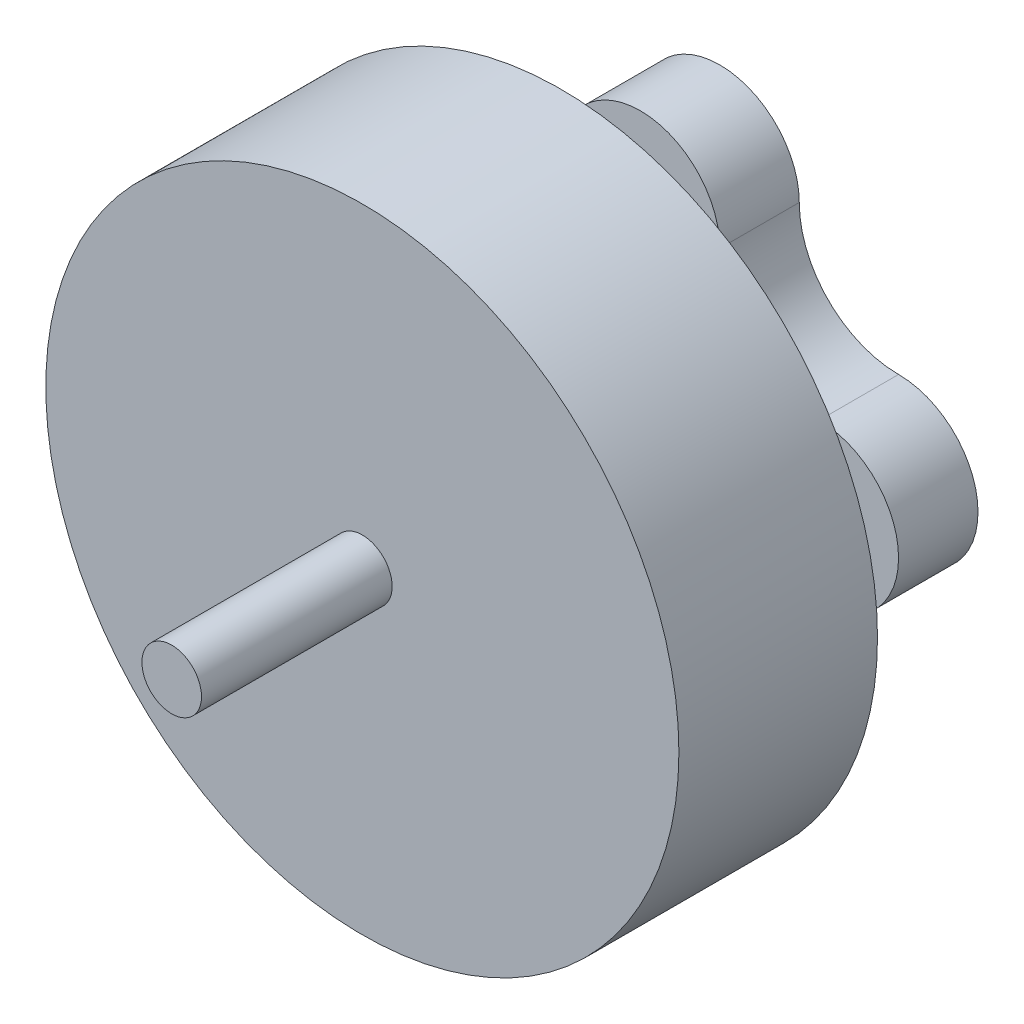
ISO-10303-21;
HEADER;
FILE_DESCRIPTION(('STEP AP214'),'2;1');
FILE_NAME('part.step','',(''),(''),'','','');
FILE_SCHEMA(('AUTOMOTIVE_DESIGN { 1 0 10303 214 1 1 1 1 }'));
ENDSEC;
DATA;
#1=APPLICATION_CONTEXT('core data for automotive mechanical design processes');
#2=APPLICATION_PROTOCOL_DEFINITION('international standard','automotive_design',2000,#1);
#3=PRODUCT_CONTEXT('',#1,'mechanical');
#4=PRODUCT('Part','Part','',(#3));
#5=PRODUCT_RELATED_PRODUCT_CATEGORY('part','',(#4));
#6=PRODUCT_DEFINITION_FORMATION('','',#4);
#7=PRODUCT_DEFINITION_CONTEXT('part definition',#1,'design');
#8=PRODUCT_DEFINITION('design','',#6,#7);
#9=PRODUCT_DEFINITION_SHAPE('','',#8);
#10=(LENGTH_UNIT() NAMED_UNIT(*) SI_UNIT(.MILLI.,.METRE.));
#11=(NAMED_UNIT(*) PLANE_ANGLE_UNIT() SI_UNIT($,.RADIAN.));
#12=(NAMED_UNIT(*) SI_UNIT($,.STERADIAN.) SOLID_ANGLE_UNIT());
#13=UNCERTAINTY_MEASURE_WITH_UNIT(LENGTH_MEASURE(1.E-05),#10,'distance_accuracy_value','');
#14=(GEOMETRIC_REPRESENTATION_CONTEXT(3) GLOBAL_UNCERTAINTY_ASSIGNED_CONTEXT((#13)) GLOBAL_UNIT_ASSIGNED_CONTEXT((#10,
#11,#12)) REPRESENTATION_CONTEXT('',''));
#15=CARTESIAN_POINT('',(0.,0.,0.));
#16=DIRECTION('',(0.,0.,1.));
#17=DIRECTION('',(1.,0.,0.));
#18=AXIS2_PLACEMENT_3D('',#15,#16,#17);
#19=CARTESIAN_POINT('',(0.,0.,5.));
#20=DIRECTION('',(0.,0.,-1.));
#21=DIRECTION('',(-1.,0.,0.));
#22=AXIS2_PLACEMENT_3D('',#19,#20,#21);
#23=CYLINDRICAL_SURFACE('',#22,7.97);
#24=CARTESIAN_POINT('',(0.,0.,5.));
#25=DIRECTION('',(0.,0.,1.));
#26=DIRECTION('',(1.,0.,0.));
#27=AXIS2_PLACEMENT_3D('',#24,#25,#26);
#28=CIRCLE('',#27,7.97);
#29=CARTESIAN_POINT('',(7.97,0.,5.));
#30=VERTEX_POINT('',#29);
#31=EDGE_CURVE('E157',#30,#30,#28,.T.);
#32=ORIENTED_EDGE('',*,*,#31,.F.);
#33=EDGE_LOOP('',(#32));
#34=FACE_BOUND('',#33,.T.);
#35=CARTESIAN_POINT('',(0.,0.,0.));
#36=DIRECTION('',(0.,0.,1.));
#37=DIRECTION('',(1.,0.,0.));
#38=AXIS2_PLACEMENT_3D('',#35,#36,#37);
#39=CIRCLE('',#38,7.97);
#40=CARTESIAN_POINT('',(7.97,0.,0.));
#41=VERTEX_POINT('',#40);
#42=EDGE_CURVE('E151',#41,#41,#39,.T.);
#43=ORIENTED_EDGE('',*,*,#42,.T.);
#44=EDGE_LOOP('',(#43));
#45=FACE_BOUND('',#44,.T.);
#46=ADVANCED_FACE('F148',(#34,#45),#23,.T.);
#47=CARTESIAN_POINT('',(0.,0.,5.));
#48=DIRECTION('',(0.,0.,1.));
#49=DIRECTION('',(1.,0.,0.));
#50=AXIS2_PLACEMENT_3D('',#47,#48,#49);
#51=PLANE('',#50);
#52=CARTESIAN_POINT('',(0.,0.,5.));
#53=DIRECTION('',(0.,0.,1.));
#54=DIRECTION('',(1.,0.,0.));
#55=AXIS2_PLACEMENT_3D('',#52,#53,#54);
#56=CIRCLE('',#55,0.75);
#57=CARTESIAN_POINT('',(0.75,0.,5.));
#58=VERTEX_POINT('',#57);
#59=EDGE_CURVE('E285',#58,#58,#56,.T.);
#60=ORIENTED_EDGE('',*,*,#59,.F.);
#61=EDGE_LOOP('',(#60));
#62=FACE_BOUND('',#61,.T.);
#63=ORIENTED_EDGE('',*,*,#31,.T.);
#64=EDGE_LOOP('',(#63));
#65=FACE_BOUND('',#64,.T.);
#66=ADVANCED_FACE('F301',(#62,#65),#51,.T.);
#67=CARTESIAN_POINT('',(0.,0.,0.));
#68=DIRECTION('',(0.,0.,1.));
#69=DIRECTION('',(1.,0.,0.));
#70=AXIS2_PLACEMENT_3D('',#67,#68,#69);
#71=PLANE('',#70);
#72=CARTESIAN_POINT('',(0.,0.,0.));
#73=DIRECTION('',(0.,0.,-1.));
#74=DIRECTION('',(-1.,0.,0.));
#75=AXIS2_PLACEMENT_3D('',#72,#73,#74);
#76=CIRCLE('',#75,2.5);
#77=CARTESIAN_POINT('',(-2.5,0.,0.));
#78=VERTEX_POINT('',#77);
#79=EDGE_CURVE('E12',#78,#78,#76,.T.);
#80=ORIENTED_EDGE('',*,*,#79,.F.);
#81=EDGE_LOOP('',(#80));
#82=FACE_BOUND('',#81,.T.);
#83=ORIENTED_EDGE('',*,*,#42,.F.);
#84=EDGE_LOOP('',(#83));
#85=FACE_BOUND('',#84,.T.);
#86=ADVANCED_FACE('F298',(#82,#85),#71,.F.);
#87=CARTESIAN_POINT('',(0.,0.,9.8));
#88=DIRECTION('',(0.,0.,-1.));
#89=DIRECTION('',(-1.,0.,0.));
#90=AXIS2_PLACEMENT_3D('',#87,#88,#89);
#91=CYLINDRICAL_SURFACE('',#90,0.75);
#92=CARTESIAN_POINT('',(0.,0.,9.8));
#93=DIRECTION('',(0.,0.,1.));
#94=DIRECTION('',(1.,0.,0.));
#95=AXIS2_PLACEMENT_3D('',#92,#93,#94);
#96=CIRCLE('',#95,0.75);
#97=CARTESIAN_POINT('',(0.75,0.,9.8));
#98=VERTEX_POINT('',#97);
#99=EDGE_CURVE('E287',#98,#98,#96,.T.);
#100=ORIENTED_EDGE('',*,*,#99,.F.);
#101=EDGE_LOOP('',(#100));
#102=FACE_BOUND('',#101,.T.);
#103=ORIENTED_EDGE('',*,*,#59,.T.);
#104=EDGE_LOOP('',(#103));
#105=FACE_BOUND('',#104,.T.);
#106=ADVANCED_FACE('F300',(#102,#105),#91,.T.);
#107=CARTESIAN_POINT('',(0.,0.,9.8));
#108=DIRECTION('',(0.,0.,1.));
#109=DIRECTION('',(1.,0.,0.));
#110=AXIS2_PLACEMENT_3D('',#107,#108,#109);
#111=PLANE('',#110);
#112=ORIENTED_EDGE('',*,*,#99,.T.);
#113=EDGE_LOOP('',(#112));
#114=FACE_BOUND('',#113,.T.);
#115=ADVANCED_FACE('F307',(#114),#111,.T.);
#116=CARTESIAN_POINT('',(0.,0.,-2.));
#117=DIRECTION('',(0.,0.,1.));
#118=DIRECTION('',(1.,0.,0.));
#119=AXIS2_PLACEMENT_3D('',#116,#117,#118);
#120=CYLINDRICAL_SURFACE('',#119,2.5);
#121=CARTESIAN_POINT('',(0.,0.,-2.));
#122=DIRECTION('',(0.,0.,-1.));
#123=DIRECTION('',(-1.,0.,0.));
#124=AXIS2_PLACEMENT_3D('',#121,#122,#123);
#125=CIRCLE('',#124,2.5);
#126=CARTESIAN_POINT('',(-2.5,0.,-2.));
#127=VERTEX_POINT('',#126);
#128=EDGE_CURVE('E283',#127,#127,#125,.T.);
#129=ORIENTED_EDGE('',*,*,#128,.F.);
#130=EDGE_LOOP('',(#129));
#131=FACE_BOUND('',#130,.T.);
#132=ORIENTED_EDGE('',*,*,#79,.T.);
#133=EDGE_LOOP('',(#132));
#134=FACE_BOUND('',#133,.T.);
#135=ADVANCED_FACE('F335',(#131,#134),#120,.T.);
#136=CARTESIAN_POINT('',(4.5,2.25,-4.));
#137=DIRECTION('',(0.,0.,1.));
#138=DIRECTION('',(1.,0.,0.));
#139=AXIS2_PLACEMENT_3D('',#136,#137,#138);
#140=PLANE('',#139);
#141=CARTESIAN_POINT('',(0.,4.5,-4.));
#142=DIRECTION('',(0.,0.,1.));
#143=DIRECTION('',(1.,0.,0.));
#144=AXIS2_PLACEMENT_3D('',#141,#142,#143);
#145=CIRCLE('',#144,0.999999999999998);
#146=CARTESIAN_POINT('',(0.999999999999997,4.5,-4.));
#147=VERTEX_POINT('',#146);
#148=EDGE_CURVE('E493',#147,#147,#145,.T.);
#149=ORIENTED_EDGE('',*,*,#148,.T.);
#150=EDGE_LOOP('',(#149));
#151=FACE_BOUND('',#150,.T.);
#152=CARTESIAN_POINT('',(-4.5,0.,-4.));
#153=DIRECTION('',(0.,0.,-1.));
#154=DIRECTION('',(-1.,0.,0.));
#155=AXIS2_PLACEMENT_3D('',#152,#153,#154);
#156=CIRCLE('',#155,0.999999999999998);
#157=CARTESIAN_POINT('',(-5.5,0.,-4.));
#158=VERTEX_POINT('',#157);
#159=EDGE_CURVE('E253',#158,#158,#156,.F.);
#160=ORIENTED_EDGE('',*,*,#159,.T.);
#161=EDGE_LOOP('',(#160));
#162=FACE_BOUND('',#161,.T.);
#163=CARTESIAN_POINT('',(4.5,4.5,-4.));
#164=DIRECTION('',(0.,0.,1.));
#165=DIRECTION('',(1.,0.,0.));
#166=AXIS2_PLACEMENT_3D('',#163,#164,#165);
#167=CIRCLE('',#166,2.5);
#168=CARTESIAN_POINT('',(2.,4.5,-4.));
#169=VERTEX_POINT('',#168);
#170=CARTESIAN_POINT('',(4.5,2.,-4.));
#171=VERTEX_POINT('',#170);
#172=EDGE_CURVE('E271',#169,#171,#167,.T.);
#173=ORIENTED_EDGE('',*,*,#172,.T.);
#174=CARTESIAN_POINT('',(4.5,0.,-4.));
#175=DIRECTION('',(0.,0.,-1.));
#176=DIRECTION('',(-1.,0.,0.));
#177=AXIS2_PLACEMENT_3D('',#174,#175,#176);
#178=CIRCLE('',#177,2.);
#179=CARTESIAN_POINT('',(4.5,-2.,-4.));
#180=VERTEX_POINT('',#179);
#181=EDGE_CURVE('E206',#171,#180,#178,.T.);
#182=ORIENTED_EDGE('',*,*,#181,.T.);
#183=CARTESIAN_POINT('',(4.5,-4.5,-4.));
#184=DIRECTION('',(0.,0.,-1.));
#185=DIRECTION('',(-1.,0.,0.));
#186=AXIS2_PLACEMENT_3D('',#183,#184,#185);
#187=CIRCLE('',#186,2.5);
#188=CARTESIAN_POINT('',(2.,-4.5,-4.));
#189=VERTEX_POINT('',#188);
#190=EDGE_CURVE('E520',#189,#180,#187,.T.);
#191=ORIENTED_EDGE('',*,*,#190,.F.);
#192=CARTESIAN_POINT('',(0.,-4.5,-4.));
#193=DIRECTION('',(0.,0.,-1.));
#194=DIRECTION('',(-1.,0.,0.));
#195=AXIS2_PLACEMENT_3D('',#192,#193,#194);
#196=CIRCLE('',#195,2.);
#197=CARTESIAN_POINT('',(-2.,-4.5,-4.));
#198=VERTEX_POINT('',#197);
#199=EDGE_CURVE('E245',#189,#198,#196,.T.);
#200=ORIENTED_EDGE('',*,*,#199,.T.);
#201=CARTESIAN_POINT('',(-4.5,-4.5,-4.));
#202=DIRECTION('',(0.,0.,-1.));
#203=DIRECTION('',(-1.,0.,0.));
#204=AXIS2_PLACEMENT_3D('',#201,#202,#203);
#205=CIRCLE('',#204,2.5);
#206=CARTESIAN_POINT('',(-4.5,-2.,-4.));
#207=VERTEX_POINT('',#206);
#208=EDGE_CURVE('E243',#207,#198,#205,.T.);
#209=ORIENTED_EDGE('',*,*,#208,.F.);
#210=CARTESIAN_POINT('',(-4.5,0.,-4.));
#211=DIRECTION('',(0.,0.,1.));
#212=DIRECTION('',(1.,0.,0.));
#213=AXIS2_PLACEMENT_3D('',#210,#211,#212);
#214=CIRCLE('',#213,2.);
#215=CARTESIAN_POINT('',(-4.5,2.,-4.));
#216=VERTEX_POINT('',#215);
#217=EDGE_CURVE('E226',#216,#207,#214,.T.);
#218=ORIENTED_EDGE('',*,*,#217,.F.);
#219=CARTESIAN_POINT('',(-4.5,4.5,-4.));
#220=DIRECTION('',(0.,0.,1.));
#221=DIRECTION('',(1.,0.,0.));
#222=AXIS2_PLACEMENT_3D('',#219,#220,#221);
#223=CIRCLE('',#222,2.5);
#224=CARTESIAN_POINT('',(-2.,4.5,-4.));
#225=VERTEX_POINT('',#224);
#226=EDGE_CURVE('E233',#216,#225,#223,.T.);
#227=ORIENTED_EDGE('',*,*,#226,.T.);
#228=CARTESIAN_POINT('',(0.,4.5,-4.));
#229=DIRECTION('',(0.,0.,1.));
#230=DIRECTION('',(1.,0.,0.));
#231=AXIS2_PLACEMENT_3D('',#228,#229,#230);
#232=CIRCLE('',#231,2.);
#233=EDGE_CURVE('E237',#169,#225,#232,.T.);
#234=ORIENTED_EDGE('',*,*,#233,.F.);
#235=EDGE_LOOP('',(#173,#182,#191,#200,#209,#218,#227,#234));
#236=FACE_BOUND('',#235,.T.);
#237=CARTESIAN_POINT('',(0.,-4.5,-4.));
#238=DIRECTION('',(0.,0.,-1.));
#239=DIRECTION('',(-1.,0.,0.));
#240=AXIS2_PLACEMENT_3D('',#237,#238,#239);
#241=CIRCLE('',#240,1.);
#242=CARTESIAN_POINT('',(-1.,-4.5,-4.));
#243=VERTEX_POINT('',#242);
#244=EDGE_CURVE('E508',#243,#243,#241,.T.);
#245=ORIENTED_EDGE('',*,*,#244,.F.);
#246=EDGE_LOOP('',(#245));
#247=FACE_BOUND('',#246,.T.);
#248=CARTESIAN_POINT('',(4.5,0.,-4.));
#249=DIRECTION('',(0.,0.,-1.));
#250=DIRECTION('',(-1.,0.,0.));
#251=AXIS2_PLACEMENT_3D('',#248,#249,#250);
#252=CIRCLE('',#251,1.);
#253=CARTESIAN_POINT('',(3.5,0.,-4.));
#254=VERTEX_POINT('',#253);
#255=EDGE_CURVE('E502',#254,#254,#252,.T.);
#256=ORIENTED_EDGE('',*,*,#255,.F.);
#257=EDGE_LOOP('',(#256));
#258=FACE_BOUND('',#257,.T.);
#259=ADVANCED_FACE('F240',(#151,#162,#236,#247,#258),#140,.F.);
#260=CARTESIAN_POINT('',(4.5,2.25,-2.));
#261=DIRECTION('',(0.,0.,1.));
#262=DIRECTION('',(1.,0.,0.));
#263=AXIS2_PLACEMENT_3D('',#260,#261,#262);
#264=PLANE('',#263);
#265=ORIENTED_EDGE('',*,*,#128,.T.);
#266=EDGE_LOOP('',(#265));
#267=FACE_BOUND('',#266,.T.);
#268=CARTESIAN_POINT('',(0.,4.5,-2.));
#269=DIRECTION('',(0.,0.,1.));
#270=DIRECTION('',(1.,0.,0.));
#271=AXIS2_PLACEMENT_3D('',#268,#269,#270);
#272=CIRCLE('',#271,0.999999999999998);
#273=CARTESIAN_POINT('',(0.999999999999997,4.5,-2.));
#274=VERTEX_POINT('',#273);
#275=EDGE_CURVE('E496',#274,#274,#272,.T.);
#276=ORIENTED_EDGE('',*,*,#275,.F.);
#277=EDGE_LOOP('',(#276));
#278=FACE_BOUND('',#277,.T.);
#279=CARTESIAN_POINT('',(0.,-4.5,-2.));
#280=DIRECTION('',(0.,0.,-1.));
#281=DIRECTION('',(-1.,0.,0.));
#282=AXIS2_PLACEMENT_3D('',#279,#280,#281);
#283=CIRCLE('',#282,1.);
#284=CARTESIAN_POINT('',(-1.,-4.5,-2.));
#285=VERTEX_POINT('',#284);
#286=EDGE_CURVE('E505',#285,#285,#283,.T.);
#287=ORIENTED_EDGE('',*,*,#286,.T.);
#288=EDGE_LOOP('',(#287));
#289=FACE_BOUND('',#288,.T.);
#290=CARTESIAN_POINT('',(-4.5,0.,-2.));
#291=DIRECTION('',(0.,0.,-1.));
#292=DIRECTION('',(-1.,0.,0.));
#293=AXIS2_PLACEMENT_3D('',#290,#291,#292);
#294=CIRCLE('',#293,0.999999999999998);
#295=CARTESIAN_POINT('',(-5.5,0.,-2.));
#296=VERTEX_POINT('',#295);
#297=EDGE_CURVE('E511',#296,#296,#294,.F.);
#298=ORIENTED_EDGE('',*,*,#297,.F.);
#299=EDGE_LOOP('',(#298));
#300=FACE_BOUND('',#299,.T.);
#301=CARTESIAN_POINT('',(4.5,4.5,-2.));
#302=DIRECTION('',(0.,0.,1.));
#303=DIRECTION('',(1.,0.,0.));
#304=AXIS2_PLACEMENT_3D('',#301,#302,#303);
#305=CIRCLE('',#304,2.5);
#306=CARTESIAN_POINT('',(2.,4.5,-2.));
#307=VERTEX_POINT('',#306);
#308=CARTESIAN_POINT('',(4.5,2.,-2.));
#309=VERTEX_POINT('',#308);
#310=EDGE_CURVE('E250',#307,#309,#305,.T.);
#311=ORIENTED_EDGE('',*,*,#310,.F.);
#312=CARTESIAN_POINT('',(0.,4.5,-2.));
#313=DIRECTION('',(0.,0.,1.));
#314=DIRECTION('',(1.,0.,0.));
#315=AXIS2_PLACEMENT_3D('',#312,#313,#314);
#316=CIRCLE('',#315,2.);
#317=CARTESIAN_POINT('',(-2.,4.5,-2.));
#318=VERTEX_POINT('',#317);
#319=EDGE_CURVE('E268',#307,#318,#316,.T.);
#320=ORIENTED_EDGE('',*,*,#319,.T.);
#321=CARTESIAN_POINT('',(-4.5,4.5,-2.));
#322=DIRECTION('',(0.,0.,1.));
#323=DIRECTION('',(1.,0.,0.));
#324=AXIS2_PLACEMENT_3D('',#321,#322,#323);
#325=CIRCLE('',#324,2.5);
#326=CARTESIAN_POINT('',(-4.5,2.,-2.));
#327=VERTEX_POINT('',#326);
#328=EDGE_CURVE('E266',#327,#318,#325,.T.);
#329=ORIENTED_EDGE('',*,*,#328,.F.);
#330=CARTESIAN_POINT('',(-4.5,0.,-2.));
#331=DIRECTION('',(0.,0.,1.));
#332=DIRECTION('',(1.,0.,0.));
#333=AXIS2_PLACEMENT_3D('',#330,#331,#332);
#334=CIRCLE('',#333,2.);
#335=CARTESIAN_POINT('',(-4.5,-2.,-2.));
#336=VERTEX_POINT('',#335);
#337=EDGE_CURVE('E228',#327,#336,#334,.T.);
#338=ORIENTED_EDGE('',*,*,#337,.T.);
#339=CARTESIAN_POINT('',(-4.5,-4.5,-2.));
#340=DIRECTION('',(0.,0.,-1.));
#341=DIRECTION('',(-1.,0.,0.));
#342=AXIS2_PLACEMENT_3D('',#339,#340,#341);
#343=CIRCLE('',#342,2.5);
#344=CARTESIAN_POINT('',(-2.,-4.5,-2.));
#345=VERTEX_POINT('',#344);
#346=EDGE_CURVE('E262',#336,#345,#343,.T.);
#347=ORIENTED_EDGE('',*,*,#346,.T.);
#348=CARTESIAN_POINT('',(0.,-4.5,-2.));
#349=DIRECTION('',(0.,0.,-1.));
#350=DIRECTION('',(-1.,0.,0.));
#351=AXIS2_PLACEMENT_3D('',#348,#349,#350);
#352=CIRCLE('',#351,2.);
#353=CARTESIAN_POINT('',(2.,-4.5,-2.));
#354=VERTEX_POINT('',#353);
#355=EDGE_CURVE('E259',#354,#345,#352,.T.);
#356=ORIENTED_EDGE('',*,*,#355,.F.);
#357=CARTESIAN_POINT('',(4.5,-4.5,-2.));
#358=DIRECTION('',(0.,0.,-1.));
#359=DIRECTION('',(-1.,0.,0.));
#360=AXIS2_PLACEMENT_3D('',#357,#358,#359);
#361=CIRCLE('',#360,2.5);
#362=CARTESIAN_POINT('',(4.5,-2.,-2.));
#363=VERTEX_POINT('',#362);
#364=EDGE_CURVE('E256',#354,#363,#361,.T.);
#365=ORIENTED_EDGE('',*,*,#364,.T.);
#366=CARTESIAN_POINT('',(4.5,0.,-2.));
#367=DIRECTION('',(0.,0.,-1.));
#368=DIRECTION('',(-1.,0.,0.));
#369=AXIS2_PLACEMENT_3D('',#366,#367,#368);
#370=CIRCLE('',#369,2.);
#371=EDGE_CURVE('E252',#309,#363,#370,.T.);
#372=ORIENTED_EDGE('',*,*,#371,.F.);
#373=EDGE_LOOP('',(#311,#320,#329,#338,#347,#356,#365,#372));
#374=FACE_BOUND('',#373,.T.);
#375=CARTESIAN_POINT('',(4.5,0.,-2.));
#376=DIRECTION('',(0.,0.,-1.));
#377=DIRECTION('',(-1.,0.,0.));
#378=AXIS2_PLACEMENT_3D('',#375,#376,#377);
#379=CIRCLE('',#378,1.);
#380=CARTESIAN_POINT('',(3.5,0.,-2.));
#381=VERTEX_POINT('',#380);
#382=EDGE_CURVE('E499',#381,#381,#379,.T.);
#383=ORIENTED_EDGE('',*,*,#382,.T.);
#384=EDGE_LOOP('',(#383));
#385=FACE_BOUND('',#384,.T.);
#386=ADVANCED_FACE('F350',(#267,#278,#289,#300,#374,#385),#264,.T.);
#387=CARTESIAN_POINT('',(4.5,4.5,-4.));
#388=DIRECTION('',(0.,0.,1.));
#389=DIRECTION('',(1.,0.,0.));
#390=AXIS2_PLACEMENT_3D('',#387,#388,#389);
#391=CYLINDRICAL_SURFACE('',#390,2.5);
#392=ORIENTED_EDGE('',*,*,#310,.T.);
#393=DIRECTION('',(0.,0.,1.));
#394=VECTOR('',#393,1.);
#395=CARTESIAN_POINT('',(4.5,2.,-4.));
#396=LINE('',#395,#394);
#397=EDGE_CURVE('E281',#171,#309,#396,.T.);
#398=ORIENTED_EDGE('',*,*,#397,.F.);
#399=ORIENTED_EDGE('',*,*,#172,.F.);
#400=DIRECTION('',(0.,0.,1.));
#401=VECTOR('',#400,1.);
#402=CARTESIAN_POINT('',(2.,4.5,-4.));
#403=LINE('',#402,#401);
#404=EDGE_CURVE('E166',#169,#307,#403,.T.);
#405=ORIENTED_EDGE('',*,*,#404,.T.);
#406=EDGE_LOOP('',(#392,#398,#399,#405));
#407=FACE_BOUND('',#406,.T.);
#408=ADVANCED_FACE('F361',(#407),#391,.F.);
#409=CARTESIAN_POINT('',(4.5,0.,-4.));
#410=DIRECTION('',(0.,0.,1.));
#411=DIRECTION('',(1.,0.,0.));
#412=AXIS2_PLACEMENT_3D('',#409,#410,#411);
#413=CYLINDRICAL_SURFACE('',#412,2.);
#414=ORIENTED_EDGE('',*,*,#371,.T.);
#415=DIRECTION('',(0.,0.,1.));
#416=VECTOR('',#415,1.);
#417=CARTESIAN_POINT('',(4.5,-2.,-4.));
#418=LINE('',#417,#416);
#419=EDGE_CURVE('E279',#180,#363,#418,.T.);
#420=ORIENTED_EDGE('',*,*,#419,.F.);
#421=ORIENTED_EDGE('',*,*,#181,.F.);
#422=ORIENTED_EDGE('',*,*,#397,.T.);
#423=EDGE_LOOP('',(#414,#420,#421,#422));
#424=FACE_BOUND('',#423,.T.);
#425=ADVANCED_FACE('F371',(#424),#413,.T.);
#426=CARTESIAN_POINT('',(4.5,-4.5,-4.));
#427=DIRECTION('',(0.,0.,1.));
#428=DIRECTION('',(1.,0.,0.));
#429=AXIS2_PLACEMENT_3D('',#426,#427,#428);
#430=CYLINDRICAL_SURFACE('',#429,2.5);
#431=ORIENTED_EDGE('',*,*,#364,.F.);
#432=DIRECTION('',(0.,0.,1.));
#433=VECTOR('',#432,1.);
#434=CARTESIAN_POINT('',(2.,-4.5,-4.));
#435=LINE('',#434,#433);
#436=EDGE_CURVE('E277',#189,#354,#435,.T.);
#437=ORIENTED_EDGE('',*,*,#436,.F.);
#438=ORIENTED_EDGE('',*,*,#190,.T.);
#439=ORIENTED_EDGE('',*,*,#419,.T.);
#440=EDGE_LOOP('',(#431,#437,#438,#439));
#441=FACE_BOUND('',#440,.T.);
#442=ADVANCED_FACE('F380',(#441),#430,.F.);
#443=CARTESIAN_POINT('',(0.,-4.5,-4.));
#444=DIRECTION('',(0.,0.,1.));
#445=DIRECTION('',(1.,0.,0.));
#446=AXIS2_PLACEMENT_3D('',#443,#444,#445);
#447=CYLINDRICAL_SURFACE('',#446,2.);
#448=ORIENTED_EDGE('',*,*,#355,.T.);
#449=DIRECTION('',(0.,0.,1.));
#450=VECTOR('',#449,1.);
#451=CARTESIAN_POINT('',(-2.,-4.5,-4.));
#452=LINE('',#451,#450);
#453=EDGE_CURVE('E275',#198,#345,#452,.T.);
#454=ORIENTED_EDGE('',*,*,#453,.F.);
#455=ORIENTED_EDGE('',*,*,#199,.F.);
#456=ORIENTED_EDGE('',*,*,#436,.T.);
#457=EDGE_LOOP('',(#448,#454,#455,#456));
#458=FACE_BOUND('',#457,.T.);
#459=ADVANCED_FACE('F389',(#458),#447,.T.);
#460=CARTESIAN_POINT('',(-4.5,-4.5,-4.));
#461=DIRECTION('',(0.,0.,1.));
#462=DIRECTION('',(1.,0.,0.));
#463=AXIS2_PLACEMENT_3D('',#460,#461,#462);
#464=CYLINDRICAL_SURFACE('',#463,2.5);
#465=ORIENTED_EDGE('',*,*,#346,.F.);
#466=DIRECTION('',(0.,0.,1.));
#467=VECTOR('',#466,1.);
#468=CARTESIAN_POINT('',(-4.5,-2.,-4.));
#469=LINE('',#468,#467);
#470=EDGE_CURVE('E231',#207,#336,#469,.T.);
#471=ORIENTED_EDGE('',*,*,#470,.F.);
#472=ORIENTED_EDGE('',*,*,#208,.T.);
#473=ORIENTED_EDGE('',*,*,#453,.T.);
#474=EDGE_LOOP('',(#465,#471,#472,#473));
#475=FACE_BOUND('',#474,.T.);
#476=ADVANCED_FACE('F399',(#475),#464,.F.);
#477=CARTESIAN_POINT('',(-4.5,0.,-4.));
#478=DIRECTION('',(0.,0.,1.));
#479=DIRECTION('',(1.,0.,0.));
#480=AXIS2_PLACEMENT_3D('',#477,#478,#479);
#481=CYLINDRICAL_SURFACE('',#480,2.);
#482=ORIENTED_EDGE('',*,*,#337,.F.);
#483=DIRECTION('',(0.,0.,1.));
#484=VECTOR('',#483,1.);
#485=CARTESIAN_POINT('',(-4.5,2.,-4.));
#486=LINE('',#485,#484);
#487=EDGE_CURVE('E222',#216,#327,#486,.T.);
#488=ORIENTED_EDGE('',*,*,#487,.F.);
#489=ORIENTED_EDGE('',*,*,#217,.T.);
#490=ORIENTED_EDGE('',*,*,#470,.T.);
#491=EDGE_LOOP('',(#482,#488,#489,#490));
#492=FACE_BOUND('',#491,.T.);
#493=ADVANCED_FACE('F224',(#492),#481,.T.);
#494=CARTESIAN_POINT('',(-4.5,4.5,-4.));
#495=DIRECTION('',(0.,0.,1.));
#496=DIRECTION('',(1.,0.,0.));
#497=AXIS2_PLACEMENT_3D('',#494,#495,#496);
#498=CYLINDRICAL_SURFACE('',#497,2.5);
#499=ORIENTED_EDGE('',*,*,#328,.T.);
#500=DIRECTION('',(0.,0.,1.));
#501=VECTOR('',#500,1.);
#502=CARTESIAN_POINT('',(-2.,4.5,-4.));
#503=LINE('',#502,#501);
#504=EDGE_CURVE('E193',#225,#318,#503,.T.);
#505=ORIENTED_EDGE('',*,*,#504,.F.);
#506=ORIENTED_EDGE('',*,*,#226,.F.);
#507=ORIENTED_EDGE('',*,*,#487,.T.);
#508=EDGE_LOOP('',(#499,#505,#506,#507));
#509=FACE_BOUND('',#508,.T.);
#510=ADVANCED_FACE('F234',(#509),#498,.F.);
#511=CARTESIAN_POINT('',(0.,4.5,-4.));
#512=DIRECTION('',(0.,0.,1.));
#513=DIRECTION('',(1.,0.,0.));
#514=AXIS2_PLACEMENT_3D('',#511,#512,#513);
#515=CYLINDRICAL_SURFACE('',#514,2.);
#516=ORIENTED_EDGE('',*,*,#319,.F.);
#517=ORIENTED_EDGE('',*,*,#404,.F.);
#518=ORIENTED_EDGE('',*,*,#233,.T.);
#519=ORIENTED_EDGE('',*,*,#504,.T.);
#520=EDGE_LOOP('',(#516,#517,#518,#519));
#521=FACE_BOUND('',#520,.T.);
#522=ADVANCED_FACE('F426',(#521),#515,.T.);
#523=CARTESIAN_POINT('',(-4.5,0.,-4.));
#524=DIRECTION('',(0.,0.,1.));
#525=DIRECTION('',(1.,0.,0.));
#526=AXIS2_PLACEMENT_3D('',#523,#524,#525);
#527=CYLINDRICAL_SURFACE('',#526,0.999999999999998);
#528=ORIENTED_EDGE('',*,*,#159,.F.);
#529=EDGE_LOOP('',(#528));
#530=FACE_BOUND('',#529,.T.);
#531=ORIENTED_EDGE('',*,*,#297,.T.);
#532=EDGE_LOOP('',(#531));
#533=FACE_BOUND('',#532,.T.);
#534=ADVANCED_FACE('F435',(#530,#533),#527,.F.);
#535=CARTESIAN_POINT('',(0.,-4.5,-4.));
#536=DIRECTION('',(0.,0.,1.));
#537=DIRECTION('',(1.,0.,0.));
#538=AXIS2_PLACEMENT_3D('',#535,#536,#537);
#539=CYLINDRICAL_SURFACE('',#538,1.);
#540=ORIENTED_EDGE('',*,*,#244,.T.);
#541=EDGE_LOOP('',(#540));
#542=FACE_BOUND('',#541,.T.);
#543=ORIENTED_EDGE('',*,*,#286,.F.);
#544=EDGE_LOOP('',(#543));
#545=FACE_BOUND('',#544,.T.);
#546=ADVANCED_FACE('F444',(#542,#545),#539,.F.);
#547=CARTESIAN_POINT('',(4.5,0.,-4.));
#548=DIRECTION('',(0.,0.,1.));
#549=DIRECTION('',(1.,0.,0.));
#550=AXIS2_PLACEMENT_3D('',#547,#548,#549);
#551=CYLINDRICAL_SURFACE('',#550,1.);
#552=ORIENTED_EDGE('',*,*,#255,.T.);
#553=EDGE_LOOP('',(#552));
#554=FACE_BOUND('',#553,.T.);
#555=ORIENTED_EDGE('',*,*,#382,.F.);
#556=EDGE_LOOP('',(#555));
#557=FACE_BOUND('',#556,.T.);
#558=ADVANCED_FACE('F454',(#554,#557),#551,.F.);
#559=CARTESIAN_POINT('',(0.,4.5,-4.));
#560=DIRECTION('',(0.,0.,1.));
#561=DIRECTION('',(1.,0.,0.));
#562=AXIS2_PLACEMENT_3D('',#559,#560,#561);
#563=CYLINDRICAL_SURFACE('',#562,0.999999999999998);
#564=ORIENTED_EDGE('',*,*,#148,.F.);
#565=EDGE_LOOP('',(#564));
#566=FACE_BOUND('',#565,.T.);
#567=ORIENTED_EDGE('',*,*,#275,.T.);
#568=EDGE_LOOP('',(#567));
#569=FACE_BOUND('',#568,.T.);
#570=ADVANCED_FACE('F464',(#566,#569),#563,.F.);
#571=CLOSED_SHELL('',(#46,#66,#86,#106,#115,#135,#259,#386,#408,#425,#442,#459,#476,#493,#510,
#522,#534,#546,#558,#570));
#572=MANIFOLD_SOLID_BREP('B2',#571);
#573=ADVANCED_BREP_SHAPE_REPRESENTATION('',(#18,#572),#14);
#574=SHAPE_DEFINITION_REPRESENTATION(#9,#573);
ENDSEC;
END-ISO-10303-21;
